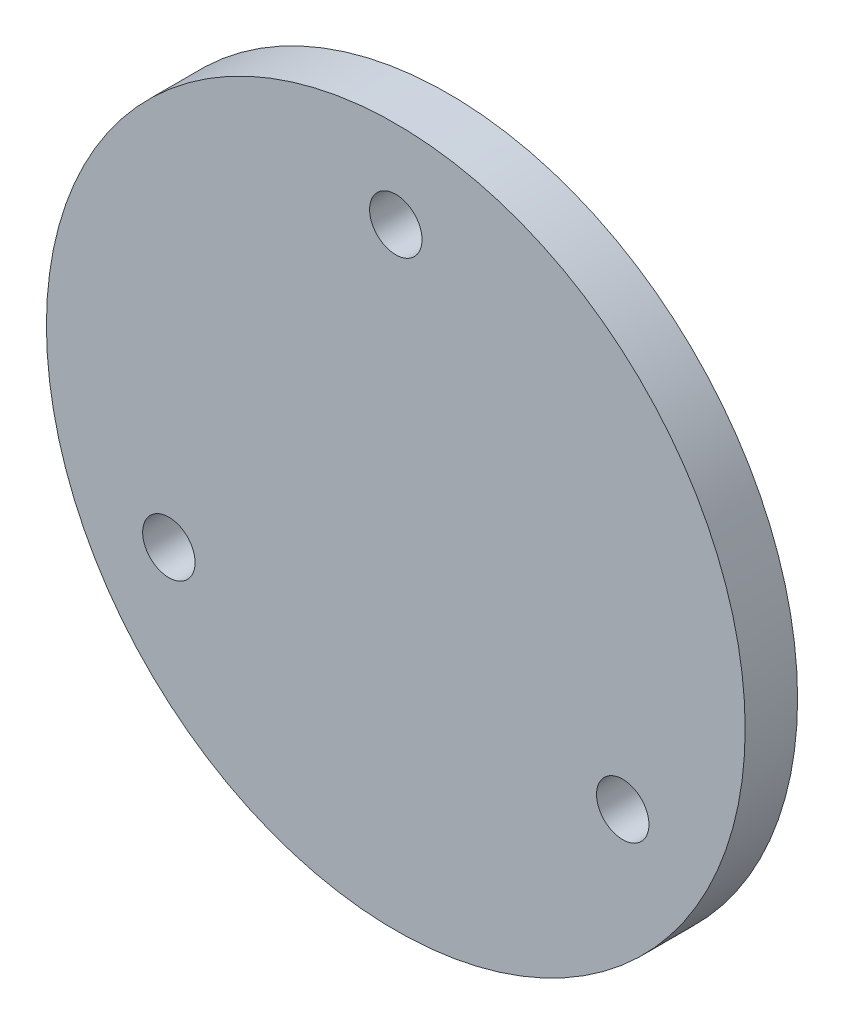
ISO-10303-21;
HEADER;
FILE_DESCRIPTION(('STEP AP214'),'2;1');
FILE_NAME('part.step','',(''),(''),'','','');
FILE_SCHEMA(('AUTOMOTIVE_DESIGN { 1 0 10303 214 1 1 1 1 }'));
ENDSEC;
DATA;
#1=APPLICATION_CONTEXT('core data for automotive mechanical design processes');
#2=APPLICATION_PROTOCOL_DEFINITION('international standard','automotive_design',2000,#1);
#3=PRODUCT_CONTEXT('',#1,'mechanical');
#4=PRODUCT('Part','Part','',(#3));
#5=PRODUCT_RELATED_PRODUCT_CATEGORY('part','',(#4));
#6=PRODUCT_DEFINITION_FORMATION('','',#4);
#7=PRODUCT_DEFINITION_CONTEXT('part definition',#1,'design');
#8=PRODUCT_DEFINITION('design','',#6,#7);
#9=PRODUCT_DEFINITION_SHAPE('','',#8);
#10=(LENGTH_UNIT() NAMED_UNIT(*) SI_UNIT(.MILLI.,.METRE.));
#11=(NAMED_UNIT(*) PLANE_ANGLE_UNIT() SI_UNIT($,.RADIAN.));
#12=(NAMED_UNIT(*) SI_UNIT($,.STERADIAN.) SOLID_ANGLE_UNIT());
#13=UNCERTAINTY_MEASURE_WITH_UNIT(LENGTH_MEASURE(1.E-05),#10,'distance_accuracy_value','');
#14=(GEOMETRIC_REPRESENTATION_CONTEXT(3) GLOBAL_UNCERTAINTY_ASSIGNED_CONTEXT((#13)) GLOBAL_UNIT_ASSIGNED_CONTEXT((#10,
#11,#12)) REPRESENTATION_CONTEXT('',''));
#15=CARTESIAN_POINT('',(0.,0.,0.));
#16=DIRECTION('',(0.,0.,1.));
#17=DIRECTION('',(1.,0.,0.));
#18=AXIS2_PLACEMENT_3D('',#15,#16,#17);
#19=CARTESIAN_POINT('',(0.,0.,3.));
#20=DIRECTION('',(0.,0.,1.));
#21=DIRECTION('',(1.,0.,0.));
#22=AXIS2_PLACEMENT_3D('',#19,#20,#21);
#23=PLANE('',#22);
#24=CARTESIAN_POINT('',(0.,15.,3.));
#25=DIRECTION('',(0.,0.,1.));
#26=DIRECTION('',(1.,0.,0.));
#27=AXIS2_PLACEMENT_3D('',#24,#25,#26);
#28=CIRCLE('',#27,1.5);
#29=CARTESIAN_POINT('',(1.5,15.,3.));
#30=VERTEX_POINT('',#29);
#31=EDGE_CURVE('E66',#30,#30,#28,.T.);
#32=ORIENTED_EDGE('',*,*,#31,.F.);
#33=EDGE_LOOP('',(#32));
#34=FACE_BOUND('',#33,.T.);
#35=CARTESIAN_POINT('',(0.,0.,3.));
#36=DIRECTION('',(0.,0.,1.));
#37=DIRECTION('',(1.,0.,0.));
#38=AXIS2_PLACEMENT_3D('',#35,#36,#37);
#39=CIRCLE('',#38,20.);
#40=CARTESIAN_POINT('',(20.,0.,3.));
#41=VERTEX_POINT('',#40);
#42=EDGE_CURVE('E11',#41,#41,#39,.T.);
#43=ORIENTED_EDGE('',*,*,#42,.T.);
#44=EDGE_LOOP('',(#43));
#45=FACE_BOUND('',#44,.T.);
#46=CARTESIAN_POINT('',(-12.9903810567665,-7.50000000000006,3.));
#47=DIRECTION('',(0.,0.,1.));
#48=DIRECTION('',(1.,0.,0.));
#49=AXIS2_PLACEMENT_3D('',#46,#47,#48);
#50=CIRCLE('',#49,1.5);
#51=CARTESIAN_POINT('',(-11.4903810567665,-7.50000000000006,3.));
#52=VERTEX_POINT('',#51);
#53=EDGE_CURVE('E61',#52,#52,#50,.T.);
#54=ORIENTED_EDGE('',*,*,#53,.F.);
#55=EDGE_LOOP('',(#54));
#56=FACE_BOUND('',#55,.T.);
#57=CARTESIAN_POINT('',(12.9903810567665,-7.50000000000006,3.));
#58=DIRECTION('',(0.,0.,1.));
#59=DIRECTION('',(1.,0.,0.));
#60=AXIS2_PLACEMENT_3D('',#57,#58,#59);
#61=CIRCLE('',#60,1.5);
#62=CARTESIAN_POINT('',(14.4903810567665,-7.50000000000006,3.));
#63=VERTEX_POINT('',#62);
#64=EDGE_CURVE('E72',#63,#63,#61,.T.);
#65=ORIENTED_EDGE('',*,*,#64,.F.);
#66=EDGE_LOOP('',(#65));
#67=FACE_BOUND('',#66,.T.);
#68=ADVANCED_FACE('F50',(#34,#45,#56,#67),#23,.T.);
#69=CARTESIAN_POINT('',(0.,0.,0.));
#70=DIRECTION('',(0.,0.,1.));
#71=DIRECTION('',(1.,0.,0.));
#72=AXIS2_PLACEMENT_3D('',#69,#70,#71);
#73=PLANE('',#72);
#74=CARTESIAN_POINT('',(0.,0.,0.));
#75=DIRECTION('',(0.,0.,1.));
#76=DIRECTION('',(1.,0.,0.));
#77=AXIS2_PLACEMENT_3D('',#74,#75,#76);
#78=CIRCLE('',#77,20.);
#79=CARTESIAN_POINT('',(20.,0.,0.));
#80=VERTEX_POINT('',#79);
#81=EDGE_CURVE('E54',#80,#80,#78,.T.);
#82=ORIENTED_EDGE('',*,*,#81,.F.);
#83=EDGE_LOOP('',(#82));
#84=FACE_BOUND('',#83,.T.);
#85=CARTESIAN_POINT('',(-12.9903810567665,-7.50000000000006,0.));
#86=DIRECTION('',(0.,0.,1.));
#87=DIRECTION('',(1.,0.,0.));
#88=AXIS2_PLACEMENT_3D('',#85,#86,#87);
#89=CIRCLE('',#88,1.5);
#90=CARTESIAN_POINT('',(-11.4903810567665,-7.50000000000006,0.));
#91=VERTEX_POINT('',#90);
#92=EDGE_CURVE('E63',#91,#91,#89,.T.);
#93=ORIENTED_EDGE('',*,*,#92,.T.);
#94=EDGE_LOOP('',(#93));
#95=FACE_BOUND('',#94,.T.);
#96=CARTESIAN_POINT('',(0.,15.,0.));
#97=DIRECTION('',(0.,0.,1.));
#98=DIRECTION('',(1.,0.,0.));
#99=AXIS2_PLACEMENT_3D('',#96,#97,#98);
#100=CIRCLE('',#99,1.5);
#101=CARTESIAN_POINT('',(1.5,15.,0.));
#102=VERTEX_POINT('',#101);
#103=EDGE_CURVE('E69',#102,#102,#100,.T.);
#104=ORIENTED_EDGE('',*,*,#103,.T.);
#105=EDGE_LOOP('',(#104));
#106=FACE_BOUND('',#105,.T.);
#107=CARTESIAN_POINT('',(12.9903810567665,-7.50000000000006,0.));
#108=DIRECTION('',(0.,0.,1.));
#109=DIRECTION('',(1.,0.,0.));
#110=AXIS2_PLACEMENT_3D('',#107,#108,#109);
#111=CIRCLE('',#110,1.5);
#112=CARTESIAN_POINT('',(14.4903810567665,-7.50000000000006,0.));
#113=VERTEX_POINT('',#112);
#114=EDGE_CURVE('E75',#113,#113,#111,.T.);
#115=ORIENTED_EDGE('',*,*,#114,.T.);
#116=EDGE_LOOP('',(#115));
#117=FACE_BOUND('',#116,.T.);
#118=ADVANCED_FACE('F85',(#84,#95,#106,#117),#73,.F.);
#119=CARTESIAN_POINT('',(0.,0.,3.));
#120=DIRECTION('',(0.,0.,-1.));
#121=DIRECTION('',(-1.,0.,0.));
#122=AXIS2_PLACEMENT_3D('',#119,#120,#121);
#123=CYLINDRICAL_SURFACE('',#122,20.);
#124=ORIENTED_EDGE('',*,*,#42,.F.);
#125=EDGE_LOOP('',(#124));
#126=FACE_BOUND('',#125,.T.);
#127=ORIENTED_EDGE('',*,*,#81,.T.);
#128=EDGE_LOOP('',(#127));
#129=FACE_BOUND('',#128,.T.);
#130=ADVANCED_FACE('F52',(#126,#129),#123,.T.);
#131=CARTESIAN_POINT('',(-12.9903810567665,-7.50000000000006,3.));
#132=DIRECTION('',(0.,0.,-1.));
#133=DIRECTION('',(-1.,0.,0.));
#134=AXIS2_PLACEMENT_3D('',#131,#132,#133);
#135=CYLINDRICAL_SURFACE('',#134,1.5);
#136=ORIENTED_EDGE('',*,*,#53,.T.);
#137=EDGE_LOOP('',(#136));
#138=FACE_BOUND('',#137,.T.);
#139=ORIENTED_EDGE('',*,*,#92,.F.);
#140=EDGE_LOOP('',(#139));
#141=FACE_BOUND('',#140,.T.);
#142=ADVANCED_FACE('F94',(#138,#141),#135,.F.);
#143=CARTESIAN_POINT('',(0.,15.,3.));
#144=DIRECTION('',(0.,0.,-1.));
#145=DIRECTION('',(-1.,0.,0.));
#146=AXIS2_PLACEMENT_3D('',#143,#144,#145);
#147=CYLINDRICAL_SURFACE('',#146,1.5);
#148=ORIENTED_EDGE('',*,*,#31,.T.);
#149=EDGE_LOOP('',(#148));
#150=FACE_BOUND('',#149,.T.);
#151=ORIENTED_EDGE('',*,*,#103,.F.);
#152=EDGE_LOOP('',(#151));
#153=FACE_BOUND('',#152,.T.);
#154=ADVANCED_FACE('F97',(#150,#153),#147,.F.);
#155=CARTESIAN_POINT('',(12.9903810567665,-7.50000000000006,3.));
#156=DIRECTION('',(0.,0.,-1.));
#157=DIRECTION('',(-1.,0.,0.));
#158=AXIS2_PLACEMENT_3D('',#155,#156,#157);
#159=CYLINDRICAL_SURFACE('',#158,1.5);
#160=ORIENTED_EDGE('',*,*,#64,.T.);
#161=EDGE_LOOP('',(#160));
#162=FACE_BOUND('',#161,.T.);
#163=ORIENTED_EDGE('',*,*,#114,.F.);
#164=EDGE_LOOP('',(#163));
#165=FACE_BOUND('',#164,.T.);
#166=ADVANCED_FACE('F81',(#162,#165),#159,.F.);
#167=CLOSED_SHELL('',(#68,#118,#130,#142,#154,#166));
#168=MANIFOLD_SOLID_BREP('B2',#167);
#169=ADVANCED_BREP_SHAPE_REPRESENTATION('',(#18,#168),#14);
#170=SHAPE_DEFINITION_REPRESENTATION(#9,#169);
ENDSEC;
END-ISO-10303-21;
